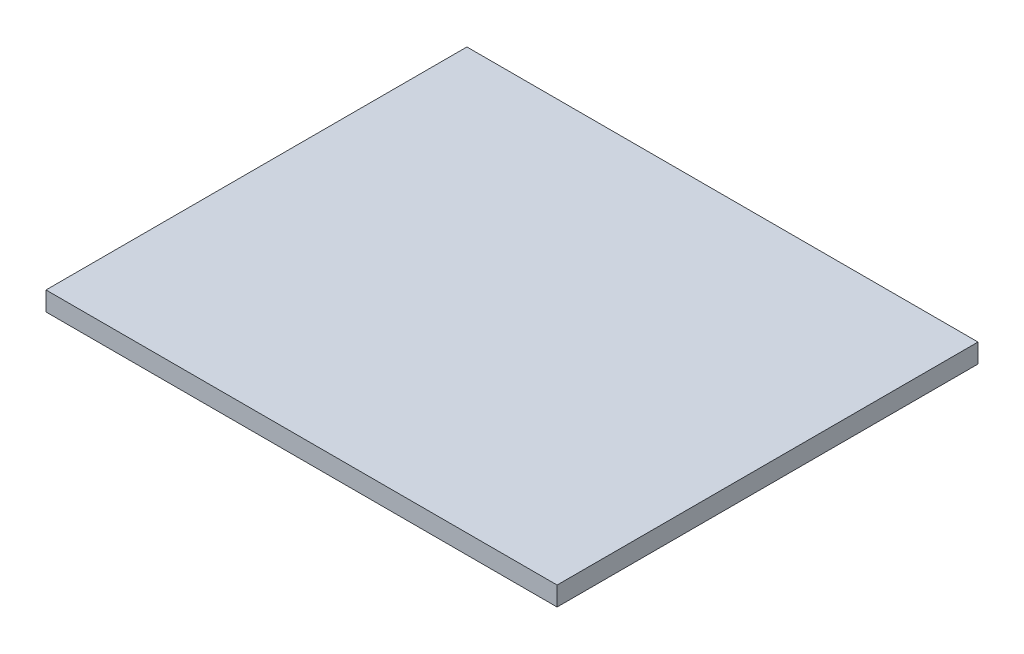
ISO-10303-21;
HEADER;
FILE_DESCRIPTION(('STEP AP214'),'2;1');
FILE_NAME('part.step','',(''),(''),'','','');
FILE_SCHEMA(('AUTOMOTIVE_DESIGN { 1 0 10303 214 1 1 1 1 }'));
ENDSEC;
DATA;
#1=APPLICATION_CONTEXT('core data for automotive mechanical design processes');
#2=APPLICATION_PROTOCOL_DEFINITION('international standard','automotive_design',2000,#1);
#3=PRODUCT_CONTEXT('',#1,'mechanical');
#4=PRODUCT('Part','Part','',(#3));
#5=PRODUCT_RELATED_PRODUCT_CATEGORY('part','',(#4));
#6=PRODUCT_DEFINITION_FORMATION('','',#4);
#7=PRODUCT_DEFINITION_CONTEXT('part definition',#1,'design');
#8=PRODUCT_DEFINITION('design','',#6,#7);
#9=PRODUCT_DEFINITION_SHAPE('','',#8);
#10=(LENGTH_UNIT() NAMED_UNIT(*) SI_UNIT(.MILLI.,.METRE.));
#11=(NAMED_UNIT(*) PLANE_ANGLE_UNIT() SI_UNIT($,.RADIAN.));
#12=(NAMED_UNIT(*) SI_UNIT($,.STERADIAN.) SOLID_ANGLE_UNIT());
#13=UNCERTAINTY_MEASURE_WITH_UNIT(LENGTH_MEASURE(1.E-05),#10,'distance_accuracy_value','');
#14=(GEOMETRIC_REPRESENTATION_CONTEXT(3) GLOBAL_UNCERTAINTY_ASSIGNED_CONTEXT((#13)) GLOBAL_UNIT_ASSIGNED_CONTEXT((#10,
#11,#12)) REPRESENTATION_CONTEXT('',''));
#15=CARTESIAN_POINT('',(0.,0.,0.));
#16=DIRECTION('',(0.,0.,1.));
#17=DIRECTION('',(1.,0.,0.));
#18=AXIS2_PLACEMENT_3D('',#15,#16,#17);
#19=CARTESIAN_POINT('',(0.,3.175,0.));
#20=DIRECTION('',(1.,0.,0.));
#21=DIRECTION('',(0.,0.,-1.));
#22=AXIS2_PLACEMENT_3D('',#19,#20,#21);
#23=PLANE('',#22);
#24=DIRECTION('',(0.,0.,1.));
#25=VECTOR('',#24,1.);
#26=CARTESIAN_POINT('',(0.,0.,0.));
#27=LINE('',#26,#25);
#28=CARTESIAN_POINT('',(0.,0.,-70.));
#29=VERTEX_POINT('',#28);
#30=CARTESIAN_POINT('',(0.,0.,0.));
#31=VERTEX_POINT('',#30);
#32=EDGE_CURVE('E96',#29,#31,#27,.T.);
#33=ORIENTED_EDGE('',*,*,#32,.T.);
#34=DIRECTION('',(0.,-1.,0.));
#35=VECTOR('',#34,1.);
#36=CARTESIAN_POINT('',(0.,3.175,0.));
#37=LINE('',#36,#35);
#38=CARTESIAN_POINT('',(0.,3.175,0.));
#39=VERTEX_POINT('',#38);
#40=EDGE_CURVE('E11',#39,#31,#37,.T.);
#41=ORIENTED_EDGE('',*,*,#40,.F.);
#42=DIRECTION('',(0.,0.,1.));
#43=VECTOR('',#42,1.);
#44=CARTESIAN_POINT('',(0.,3.175,0.));
#45=LINE('',#44,#43);
#46=CARTESIAN_POINT('',(0.,3.175,-70.));
#47=VERTEX_POINT('',#46);
#48=EDGE_CURVE('E84',#47,#39,#45,.T.);
#49=ORIENTED_EDGE('',*,*,#48,.F.);
#50=DIRECTION('',(0.,-1.,0.));
#51=VECTOR('',#50,1.);
#52=CARTESIAN_POINT('',(0.,3.175,-70.));
#53=LINE('',#52,#51);
#54=EDGE_CURVE('E92',#47,#29,#53,.T.);
#55=ORIENTED_EDGE('',*,*,#54,.T.);
#56=EDGE_LOOP('',(#33,#41,#49,#55));
#57=FACE_BOUND('',#56,.T.);
#58=ADVANCED_FACE('F33',(#57),#23,.F.);
#59=CARTESIAN_POINT('',(0.,3.175,0.));
#60=DIRECTION('',(0.,0.,-1.));
#61=DIRECTION('',(-1.,0.,0.));
#62=AXIS2_PLACEMENT_3D('',#59,#60,#61);
#63=PLANE('',#62);
#64=DIRECTION('',(1.,0.,0.));
#65=VECTOR('',#64,1.);
#66=CARTESIAN_POINT('',(0.,0.,0.));
#67=LINE('',#66,#65);
#68=CARTESIAN_POINT('',(85.,0.,0.));
#69=VERTEX_POINT('',#68);
#70=EDGE_CURVE('E88',#31,#69,#67,.T.);
#71=ORIENTED_EDGE('',*,*,#70,.T.);
#72=DIRECTION('',(0.,-1.,0.));
#73=VECTOR('',#72,1.);
#74=CARTESIAN_POINT('',(85.,3.175,0.));
#75=LINE('',#74,#73);
#76=CARTESIAN_POINT('',(85.,3.175,0.));
#77=VERTEX_POINT('',#76);
#78=EDGE_CURVE('E41',#77,#69,#75,.T.);
#79=ORIENTED_EDGE('',*,*,#78,.F.);
#80=DIRECTION('',(1.,0.,0.));
#81=VECTOR('',#80,1.);
#82=CARTESIAN_POINT('',(0.,3.175,0.));
#83=LINE('',#82,#81);
#84=EDGE_CURVE('E79',#39,#77,#83,.T.);
#85=ORIENTED_EDGE('',*,*,#84,.F.);
#86=ORIENTED_EDGE('',*,*,#40,.T.);
#87=EDGE_LOOP('',(#71,#79,#85,#86));
#88=FACE_BOUND('',#87,.T.);
#89=ADVANCED_FACE('F87',(#88),#63,.F.);
#90=CARTESIAN_POINT('',(85.,3.175,0.));
#91=DIRECTION('',(-1.,0.,0.));
#92=DIRECTION('',(0.,0.,1.));
#93=AXIS2_PLACEMENT_3D('',#90,#91,#92);
#94=PLANE('',#93);
#95=DIRECTION('',(0.,0.,-1.));
#96=VECTOR('',#95,1.);
#97=CARTESIAN_POINT('',(85.,0.,0.));
#98=LINE('',#97,#96);
#99=CARTESIAN_POINT('',(85.,0.,-70.));
#100=VERTEX_POINT('',#99);
#101=EDGE_CURVE('E66',#69,#100,#98,.T.);
#102=ORIENTED_EDGE('',*,*,#101,.T.);
#103=DIRECTION('',(0.,-1.,0.));
#104=VECTOR('',#103,1.);
#105=CARTESIAN_POINT('',(85.,3.175,-70.));
#106=LINE('',#105,#104);
#107=CARTESIAN_POINT('',(85.,3.175,-70.));
#108=VERTEX_POINT('',#107);
#109=EDGE_CURVE('E89',#108,#100,#106,.T.);
#110=ORIENTED_EDGE('',*,*,#109,.F.);
#111=DIRECTION('',(0.,0.,-1.));
#112=VECTOR('',#111,1.);
#113=CARTESIAN_POINT('',(85.,3.175,0.));
#114=LINE('',#113,#112);
#115=EDGE_CURVE('E82',#77,#108,#114,.T.);
#116=ORIENTED_EDGE('',*,*,#115,.F.);
#117=ORIENTED_EDGE('',*,*,#78,.T.);
#118=EDGE_LOOP('',(#102,#110,#116,#117));
#119=FACE_BOUND('',#118,.T.);
#120=ADVANCED_FACE('F90',(#119),#94,.F.);
#121=CARTESIAN_POINT('',(0.,3.175,-70.));
#122=DIRECTION('',(0.,0.,1.));
#123=DIRECTION('',(1.,0.,0.));
#124=AXIS2_PLACEMENT_3D('',#121,#122,#123);
#125=PLANE('',#124);
#126=DIRECTION('',(-1.,0.,0.));
#127=VECTOR('',#126,1.);
#128=CARTESIAN_POINT('',(0.,0.,-70.));
#129=LINE('',#128,#127);
#130=EDGE_CURVE('E72',#100,#29,#129,.T.);
#131=ORIENTED_EDGE('',*,*,#130,.T.);
#132=ORIENTED_EDGE('',*,*,#54,.F.);
#133=DIRECTION('',(-1.,0.,0.));
#134=VECTOR('',#133,1.);
#135=CARTESIAN_POINT('',(0.,3.175,-70.));
#136=LINE('',#135,#134);
#137=EDGE_CURVE('E49',#108,#47,#136,.T.);
#138=ORIENTED_EDGE('',*,*,#137,.F.);
#139=ORIENTED_EDGE('',*,*,#109,.T.);
#140=EDGE_LOOP('',(#131,#132,#138,#139));
#141=FACE_BOUND('',#140,.T.);
#142=ADVANCED_FACE('F103',(#141),#125,.F.);
#143=CARTESIAN_POINT('',(0.,3.175,0.));
#144=DIRECTION('',(0.,-1.,0.));
#145=DIRECTION('',(0.,0.,-1.));
#146=AXIS2_PLACEMENT_3D('',#143,#144,#145);
#147=PLANE('',#146);
#148=ORIENTED_EDGE('',*,*,#48,.T.);
#149=ORIENTED_EDGE('',*,*,#84,.T.);
#150=ORIENTED_EDGE('',*,*,#115,.T.);
#151=ORIENTED_EDGE('',*,*,#137,.T.);
#152=EDGE_LOOP('',(#148,#149,#150,#151));
#153=FACE_BOUND('',#152,.T.);
#154=ADVANCED_FACE('F80',(#153),#147,.F.);
#155=CARTESIAN_POINT('',(0.,0.,0.));
#156=DIRECTION('',(0.,-1.,0.));
#157=DIRECTION('',(0.,0.,-1.));
#158=AXIS2_PLACEMENT_3D('',#155,#156,#157);
#159=PLANE('',#158);
#160=ORIENTED_EDGE('',*,*,#32,.F.);
#161=ORIENTED_EDGE('',*,*,#130,.F.);
#162=ORIENTED_EDGE('',*,*,#101,.F.);
#163=ORIENTED_EDGE('',*,*,#70,.F.);
#164=EDGE_LOOP('',(#160,#161,#162,#163));
#165=FACE_BOUND('',#164,.T.);
#166=ADVANCED_FACE('F106',(#165),#159,.T.);
#167=CLOSED_SHELL('',(#58,#89,#120,#142,#154,#166));
#168=MANIFOLD_SOLID_BREP('B2',#167);
#169=ADVANCED_BREP_SHAPE_REPRESENTATION('',(#18,#168),#14);
#170=SHAPE_DEFINITION_REPRESENTATION(#9,#169);
ENDSEC;
END-ISO-10303-21;
